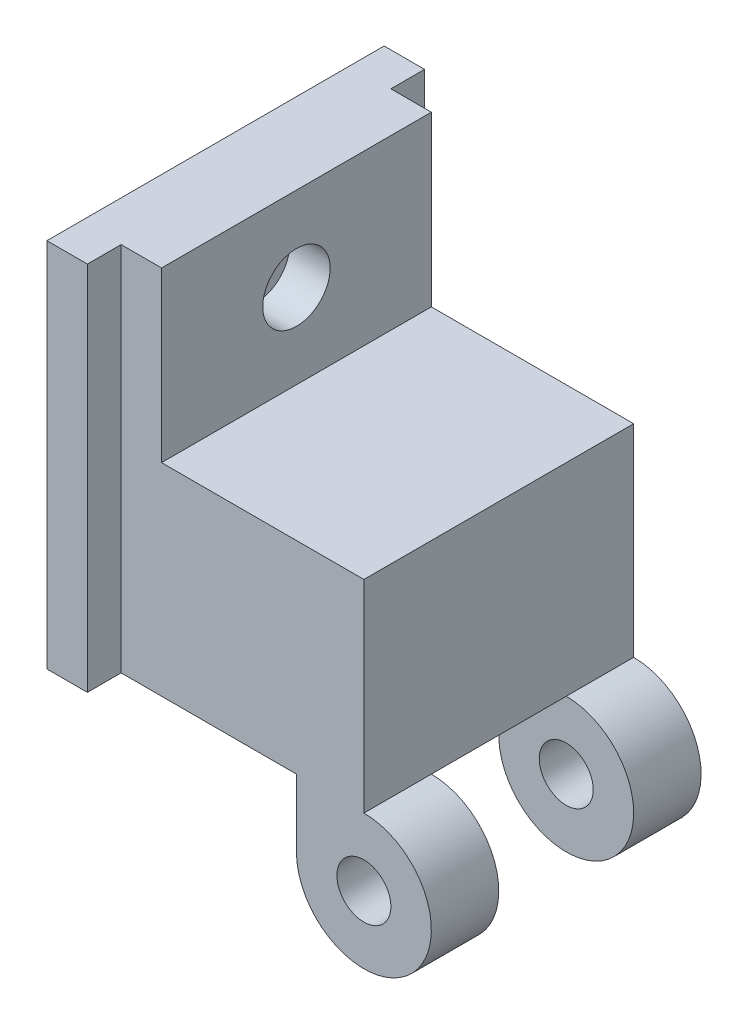
ISO-10303-21;
HEADER;
FILE_DESCRIPTION(('STEP AP214'),'2;1');
FILE_NAME('part.step','',(''),(''),'','','');
FILE_SCHEMA(('AUTOMOTIVE_DESIGN { 1 0 10303 214 1 1 1 1 }'));
ENDSEC;
DATA;
#1=APPLICATION_CONTEXT('core data for automotive mechanical design processes');
#2=APPLICATION_PROTOCOL_DEFINITION('international standard','automotive_design',2000,#1);
#3=PRODUCT_CONTEXT('',#1,'mechanical');
#4=PRODUCT('Part','Part','',(#3));
#5=PRODUCT_RELATED_PRODUCT_CATEGORY('part','',(#4));
#6=PRODUCT_DEFINITION_FORMATION('','',#4);
#7=PRODUCT_DEFINITION_CONTEXT('part definition',#1,'design');
#8=PRODUCT_DEFINITION('design','',#6,#7);
#9=PRODUCT_DEFINITION_SHAPE('','',#8);
#10=(LENGTH_UNIT() NAMED_UNIT(*) SI_UNIT(.MILLI.,.METRE.));
#11=(NAMED_UNIT(*) PLANE_ANGLE_UNIT() SI_UNIT($,.RADIAN.));
#12=(NAMED_UNIT(*) SI_UNIT($,.STERADIAN.) SOLID_ANGLE_UNIT());
#13=UNCERTAINTY_MEASURE_WITH_UNIT(LENGTH_MEASURE(1.E-05),#10,'distance_accuracy_value','');
#14=(GEOMETRIC_REPRESENTATION_CONTEXT(3) GLOBAL_UNCERTAINTY_ASSIGNED_CONTEXT((#13)) GLOBAL_UNIT_ASSIGNED_CONTEXT((#10,
#11,#12)) REPRESENTATION_CONTEXT('',''));
#15=CARTESIAN_POINT('',(0.,0.,0.));
#16=DIRECTION('',(0.,0.,1.));
#17=DIRECTION('',(1.,0.,0.));
#18=AXIS2_PLACEMENT_3D('',#15,#16,#17);
#19=CARTESIAN_POINT('',(-10.2426406871193,13.75,0.));
#20=DIRECTION('',(1.,0.,0.));
#21=DIRECTION('',(0.,0.,-1.));
#22=AXIS2_PLACEMENT_3D('',#19,#20,#21);
#23=CYLINDRICAL_SURFACE('',#22,1.5);
#24=CARTESIAN_POINT('',(-6.,13.75,0.));
#25=DIRECTION('',(-1.,0.,0.));
#26=DIRECTION('',(0.,0.,1.));
#27=AXIS2_PLACEMENT_3D('',#24,#25,#26);
#28=CIRCLE('',#27,1.5);
#29=CARTESIAN_POINT('',(-6.,13.75,1.5));
#30=VERTEX_POINT('',#29);
#31=EDGE_CURVE('E385',#30,#30,#28,.F.);
#32=ORIENTED_EDGE('',*,*,#31,.F.);
#33=EDGE_LOOP('',(#32));
#34=FACE_BOUND('',#33,.T.);
#35=CARTESIAN_POINT('',(-3.,13.75,0.));
#36=DIRECTION('',(1.,0.,0.));
#37=DIRECTION('',(0.,0.,-1.));
#38=AXIS2_PLACEMENT_3D('',#35,#36,#37);
#39=CIRCLE('',#38,1.5);
#40=CARTESIAN_POINT('',(-3.,13.75,-1.5));
#41=VERTEX_POINT('',#40);
#42=EDGE_CURVE('E381',#41,#41,#39,.T.);
#43=ORIENTED_EDGE('',*,*,#42,.T.);
#44=EDGE_LOOP('',(#43));
#45=FACE_BOUND('',#44,.T.);
#46=ADVANCED_FACE('F39',(#34,#45),#23,.F.);
#47=CARTESIAN_POINT('',(15.,-7.50000000000001,10.0000000000001));
#48=DIRECTION('',(0.,1.,0.));
#49=DIRECTION('',(0.,0.,1.));
#50=AXIS2_PLACEMENT_3D('',#47,#48,#49);
#51=PLANE('',#50);
#52=DIRECTION('',(-1.,0.,0.));
#53=VECTOR('',#52,1.);
#54=CARTESIAN_POINT('',(15.,-7.50000000000001,-5.00000000000007));
#55=LINE('',#54,#53);
#56=CARTESIAN_POINT('',(15.,-7.50000000000001,-5.00000000000007));
#57=VERTEX_POINT('',#56);
#58=CARTESIAN_POINT('',(10.0155671222792,-7.50000000000001,-5.00000000000007));
#59=VERTEX_POINT('',#58);
#60=EDGE_CURVE('E189',#57,#59,#55,.T.);
#61=ORIENTED_EDGE('',*,*,#60,.F.);
#62=DIRECTION('',(0.,0.,-1.));
#63=VECTOR('',#62,1.);
#64=CARTESIAN_POINT('',(15.,-7.50000000000001,10.0000000000001));
#65=LINE('',#64,#63);
#66=CARTESIAN_POINT('',(15.,-7.50000000000001,5.00000000000007));
#67=VERTEX_POINT('',#66);
#68=EDGE_CURVE('E136',#67,#57,#65,.T.);
#69=ORIENTED_EDGE('',*,*,#68,.F.);
#70=DIRECTION('',(-1.,0.,0.));
#71=VECTOR('',#70,1.);
#72=CARTESIAN_POINT('',(15.,-7.50000000000001,5.00000000000007));
#73=LINE('',#72,#71);
#74=CARTESIAN_POINT('',(10.0155671222792,-7.50000000000001,5.00000000000007));
#75=VERTEX_POINT('',#74);
#76=EDGE_CURVE('E124',#67,#75,#73,.T.);
#77=ORIENTED_EDGE('',*,*,#76,.T.);
#78=DIRECTION('',(0.,0.,1.));
#79=VECTOR('',#78,1.);
#80=CARTESIAN_POINT('',(10.0155671222792,-7.50000000000001,5.00000000000007));
#81=LINE('',#80,#79);
#82=CARTESIAN_POINT('',(10.0155671222792,-7.50000000000001,10.0000000000001));
#83=VERTEX_POINT('',#82);
#84=EDGE_CURVE('E104',#75,#83,#81,.T.);
#85=ORIENTED_EDGE('',*,*,#84,.T.);
#86=DIRECTION('',(-1.,0.,0.));
#87=VECTOR('',#86,1.);
#88=CARTESIAN_POINT('',(15.,-7.50000000000001,10.0000000000001));
#89=LINE('',#88,#87);
#90=CARTESIAN_POINT('',(-3.,-7.50000000000001,10.0000000000001));
#91=VERTEX_POINT('',#90);
#92=EDGE_CURVE('E122',#83,#91,#89,.T.);
#93=ORIENTED_EDGE('',*,*,#92,.T.);
#94=DIRECTION('',(0.,0.,-1.));
#95=VECTOR('',#94,1.);
#96=CARTESIAN_POINT('',(-3.,-7.50000000000001,10.0000000000001));
#97=LINE('',#96,#95);
#98=CARTESIAN_POINT('',(-3.,-7.50000000000001,12.5));
#99=VERTEX_POINT('',#98);
#100=EDGE_CURVE('E404',#99,#91,#97,.T.);
#101=ORIENTED_EDGE('',*,*,#100,.F.);
#102=DIRECTION('',(1.,0.,0.));
#103=VECTOR('',#102,1.);
#104=CARTESIAN_POINT('',(-3.,-7.50000000000001,12.5));
#105=LINE('',#104,#103);
#106=CARTESIAN_POINT('',(-6.,-7.50000000000001,12.5));
#107=VERTEX_POINT('',#106);
#108=EDGE_CURVE('E401',#107,#99,#105,.T.);
#109=ORIENTED_EDGE('',*,*,#108,.F.);
#110=DIRECTION('',(0.,0.,1.));
#111=VECTOR('',#110,1.);
#112=CARTESIAN_POINT('',(-6.,-7.50000000000001,12.5));
#113=LINE('',#112,#111);
#114=CARTESIAN_POINT('',(-6.,-7.50000000000001,-12.5));
#115=VERTEX_POINT('',#114);
#116=EDGE_CURVE('E398',#115,#107,#113,.T.);
#117=ORIENTED_EDGE('',*,*,#116,.F.);
#118=DIRECTION('',(-1.,0.,0.));
#119=VECTOR('',#118,1.);
#120=CARTESIAN_POINT('',(-6.,-7.50000000000001,-12.5));
#121=LINE('',#120,#119);
#122=CARTESIAN_POINT('',(-3.,-7.50000000000001,-12.5));
#123=VERTEX_POINT('',#122);
#124=EDGE_CURVE('E395',#123,#115,#121,.T.);
#125=ORIENTED_EDGE('',*,*,#124,.F.);
#126=DIRECTION('',(0.,0.,-1.));
#127=VECTOR('',#126,1.);
#128=CARTESIAN_POINT('',(-3.,-7.50000000000001,-12.5));
#129=LINE('',#128,#127);
#130=CARTESIAN_POINT('',(-3.,-7.50000000000001,-9.99999999999993));
#131=VERTEX_POINT('',#130);
#132=EDGE_CURVE('E389',#131,#123,#129,.T.);
#133=ORIENTED_EDGE('',*,*,#132,.F.);
#134=DIRECTION('',(-1.,0.,0.));
#135=VECTOR('',#134,1.);
#136=CARTESIAN_POINT('',(15.,-7.50000000000001,-9.99999999999993));
#137=LINE('',#136,#135);
#138=CARTESIAN_POINT('',(10.0155671222792,-7.50000000000001,-10.0000000000001));
#139=VERTEX_POINT('',#138);
#140=EDGE_CURVE('E138',#139,#131,#137,.T.);
#141=ORIENTED_EDGE('',*,*,#140,.F.);
#142=DIRECTION('',(0.,0.,-1.));
#143=VECTOR('',#142,1.);
#144=CARTESIAN_POINT('',(10.0155671222792,-7.50000000000001,-5.00000000000007));
#145=LINE('',#144,#143);
#146=EDGE_CURVE('E199',#59,#139,#145,.T.);
#147=ORIENTED_EDGE('',*,*,#146,.F.);
#148=EDGE_LOOP('',(#61,#69,#77,#85,#93,#101,#109,#117,#125,#133,#141,#147));
#149=FACE_BOUND('',#148,.T.);
#150=ADVANCED_FACE('F211',(#149),#51,.F.);
#151=CARTESIAN_POINT('',(15.,-7.50000000000001,-9.99999999999993));
#152=DIRECTION('',(0.,0.,1.));
#153=DIRECTION('',(1.,0.,0.));
#154=AXIS2_PLACEMENT_3D('',#151,#152,#153);
#155=PLANE('',#154);
#156=ORIENTED_EDGE('',*,*,#140,.T.);
#157=DIRECTION('',(0.,-1.,0.));
#158=VECTOR('',#157,1.);
#159=CARTESIAN_POINT('',(-3.,20.,-9.99999999999993));
#160=LINE('',#159,#158);
#161=CARTESIAN_POINT('',(-3.,20.,-9.99999999999993));
#162=VERTEX_POINT('',#161);
#163=EDGE_CURVE('E181',#162,#131,#160,.T.);
#164=ORIENTED_EDGE('',*,*,#163,.F.);
#165=DIRECTION('',(1.,0.,0.));
#166=VECTOR('',#165,1.);
#167=CARTESIAN_POINT('',(0.,20.,-9.99999999999993));
#168=LINE('',#167,#166);
#169=CARTESIAN_POINT('',(0.,20.,-9.99999999999993));
#170=VERTEX_POINT('',#169);
#171=EDGE_CURVE('E165',#162,#170,#168,.T.);
#172=ORIENTED_EDGE('',*,*,#171,.T.);
#173=DIRECTION('',(0.,-1.,0.));
#174=VECTOR('',#173,1.);
#175=CARTESIAN_POINT('',(0.,20.,-9.99999999999993));
#176=LINE('',#175,#174);
#177=CARTESIAN_POINT('',(0.,7.50000000000001,-9.99999999999993));
#178=VERTEX_POINT('',#177);
#179=EDGE_CURVE('E154',#170,#178,#176,.T.);
#180=ORIENTED_EDGE('',*,*,#179,.T.);
#181=DIRECTION('',(-1.,0.,0.));
#182=VECTOR('',#181,1.);
#183=CARTESIAN_POINT('',(15.,7.50000000000001,-9.99999999999993));
#184=LINE('',#183,#182);
#185=CARTESIAN_POINT('',(15.,7.50000000000001,-9.99999999999993));
#186=VERTEX_POINT('',#185);
#187=EDGE_CURVE('E11',#186,#178,#184,.T.);
#188=ORIENTED_EDGE('',*,*,#187,.F.);
#189=DIRECTION('',(0.,1.,0.));
#190=VECTOR('',#189,1.);
#191=CARTESIAN_POINT('',(15.,-7.50000000000001,-9.99999999999993));
#192=LINE('',#191,#190);
#193=CARTESIAN_POINT('',(15.,-7.50000000000001,-9.99999999999993));
#194=VERTEX_POINT('',#193);
#195=EDGE_CURVE('E129',#194,#186,#192,.T.);
#196=ORIENTED_EDGE('',*,*,#195,.F.);
#197=CARTESIAN_POINT('',(15.,-12.5,-10.0000000000001));
#198=DIRECTION('',(0.,0.,1.));
#199=DIRECTION('',(1.,0.,0.));
#200=AXIS2_PLACEMENT_3D('',#197,#198,#199);
#201=CIRCLE('',#200,5.);
#202=CARTESIAN_POINT('',(10.0155671222792,-12.1057552949038,-10.0000000000001));
#203=VERTEX_POINT('',#202);
#204=EDGE_CURVE('E63',#203,#194,#201,.T.);
#205=ORIENTED_EDGE('',*,*,#204,.F.);
#206=DIRECTION('',(0.,-1.,0.));
#207=VECTOR('',#206,1.);
#208=CARTESIAN_POINT('',(10.0155671222792,-12.1057552949038,-10.0000000000001));
#209=LINE('',#208,#207);
#210=EDGE_CURVE('E186',#139,#203,#209,.T.);
#211=ORIENTED_EDGE('',*,*,#210,.F.);
#212=EDGE_LOOP('',(#156,#164,#172,#180,#188,#196,#205,#211));
#213=FACE_BOUND('',#212,.T.);
#214=CARTESIAN_POINT('',(15.,-12.5,-10.0000000000001));
#215=DIRECTION('',(0.,0.,1.));
#216=DIRECTION('',(1.,0.,0.));
#217=AXIS2_PLACEMENT_3D('',#214,#215,#216);
#218=CIRCLE('',#217,2.00000000000001);
#219=CARTESIAN_POINT('',(17.,-12.5,-10.0000000000001));
#220=VERTEX_POINT('',#219);
#221=EDGE_CURVE('E178',#220,#220,#218,.T.);
#222=ORIENTED_EDGE('',*,*,#221,.T.);
#223=EDGE_LOOP('',(#222));
#224=FACE_BOUND('',#223,.T.);
#225=ADVANCED_FACE('F41',(#213,#224),#155,.F.);
#226=CARTESIAN_POINT('',(15.,7.50000000000001,10.0000000000001));
#227=DIRECTION('',(0.,-1.,0.));
#228=DIRECTION('',(0.,0.,-1.));
#229=AXIS2_PLACEMENT_3D('',#226,#227,#228);
#230=PLANE('',#229);
#231=DIRECTION('',(0.,0.,1.));
#232=VECTOR('',#231,1.);
#233=CARTESIAN_POINT('',(0.,7.50000000000001,10.0000000000001));
#234=LINE('',#233,#232);
#235=CARTESIAN_POINT('',(0.,7.50000000000001,10.0000000000001));
#236=VERTEX_POINT('',#235);
#237=EDGE_CURVE('E103',#178,#236,#234,.T.);
#238=ORIENTED_EDGE('',*,*,#237,.T.);
#239=DIRECTION('',(-1.,0.,0.));
#240=VECTOR('',#239,1.);
#241=CARTESIAN_POINT('',(15.,7.50000000000001,10.0000000000001));
#242=LINE('',#241,#240);
#243=CARTESIAN_POINT('',(15.,7.50000000000001,10.0000000000001));
#244=VERTEX_POINT('',#243);
#245=EDGE_CURVE('E47',#244,#236,#242,.T.);
#246=ORIENTED_EDGE('',*,*,#245,.F.);
#247=DIRECTION('',(0.,0.,1.));
#248=VECTOR('',#247,1.);
#249=CARTESIAN_POINT('',(15.,7.50000000000001,10.0000000000001));
#250=LINE('',#249,#248);
#251=EDGE_CURVE('E132',#186,#244,#250,.T.);
#252=ORIENTED_EDGE('',*,*,#251,.F.);
#253=ORIENTED_EDGE('',*,*,#187,.T.);
#254=EDGE_LOOP('',(#238,#246,#252,#253));
#255=FACE_BOUND('',#254,.T.);
#256=ADVANCED_FACE('F147',(#255),#230,.F.);
#257=CARTESIAN_POINT('',(15.,-7.50000000000001,10.0000000000001));
#258=DIRECTION('',(0.,0.,-1.));
#259=DIRECTION('',(-1.,0.,0.));
#260=AXIS2_PLACEMENT_3D('',#257,#258,#259);
#261=PLANE('',#260);
#262=ORIENTED_EDGE('',*,*,#245,.T.);
#263=DIRECTION('',(0.,-1.,0.));
#264=VECTOR('',#263,1.);
#265=CARTESIAN_POINT('',(0.,20.,10.0000000000001));
#266=LINE('',#265,#264);
#267=CARTESIAN_POINT('',(0.,20.,10.0000000000001));
#268=VERTEX_POINT('',#267);
#269=EDGE_CURVE('E76',#268,#236,#266,.T.);
#270=ORIENTED_EDGE('',*,*,#269,.F.);
#271=DIRECTION('',(-1.,0.,0.));
#272=VECTOR('',#271,1.);
#273=CARTESIAN_POINT('',(-3.,20.,10.0000000000001));
#274=LINE('',#273,#272);
#275=CARTESIAN_POINT('',(-3.,20.,10.0000000000001));
#276=VERTEX_POINT('',#275);
#277=EDGE_CURVE('E412',#268,#276,#274,.T.);
#278=ORIENTED_EDGE('',*,*,#277,.T.);
#279=DIRECTION('',(0.,-1.,0.));
#280=VECTOR('',#279,1.);
#281=CARTESIAN_POINT('',(-3.,20.,10.0000000000001));
#282=LINE('',#281,#280);
#283=EDGE_CURVE('E168',#276,#91,#282,.T.);
#284=ORIENTED_EDGE('',*,*,#283,.T.);
#285=ORIENTED_EDGE('',*,*,#92,.F.);
#286=DIRECTION('',(0.,-1.,0.));
#287=VECTOR('',#286,1.);
#288=CARTESIAN_POINT('',(10.0155671222792,-12.1057552949038,10.0000000000001));
#289=LINE('',#288,#287);
#290=CARTESIAN_POINT('',(10.0155671222792,-12.1057552949038,10.0000000000001));
#291=VERTEX_POINT('',#290);
#292=EDGE_CURVE('E99',#83,#291,#289,.T.);
#293=ORIENTED_EDGE('',*,*,#292,.T.);
#294=CARTESIAN_POINT('',(15.,-12.5,10.0000000000001));
#295=DIRECTION('',(0.,0.,1.));
#296=DIRECTION('',(1.,0.,0.));
#297=AXIS2_PLACEMENT_3D('',#294,#295,#296);
#298=CIRCLE('',#297,5.);
#299=CARTESIAN_POINT('',(15.,-7.50000000000001,10.0000000000001));
#300=VERTEX_POINT('',#299);
#301=EDGE_CURVE('E107',#291,#300,#298,.T.);
#302=ORIENTED_EDGE('',*,*,#301,.T.);
#303=DIRECTION('',(0.,-1.,0.));
#304=VECTOR('',#303,1.);
#305=CARTESIAN_POINT('',(15.,-7.50000000000001,10.0000000000001));
#306=LINE('',#305,#304);
#307=EDGE_CURVE('E134',#244,#300,#306,.T.);
#308=ORIENTED_EDGE('',*,*,#307,.F.);
#309=EDGE_LOOP('',(#262,#270,#278,#284,#285,#293,#302,#308));
#310=FACE_BOUND('',#309,.T.);
#311=CARTESIAN_POINT('',(15.,-12.5,10.0000000000001));
#312=DIRECTION('',(0.,0.,1.));
#313=DIRECTION('',(1.,0.,0.));
#314=AXIS2_PLACEMENT_3D('',#311,#312,#313);
#315=CIRCLE('',#314,2.00000000000001);
#316=CARTESIAN_POINT('',(17.,-12.5,10.0000000000001));
#317=VERTEX_POINT('',#316);
#318=EDGE_CURVE('E198',#317,#317,#315,.T.);
#319=ORIENTED_EDGE('',*,*,#318,.F.);
#320=EDGE_LOOP('',(#319));
#321=FACE_BOUND('',#320,.T.);
#322=ADVANCED_FACE('F118',(#310,#321),#261,.F.);
#323=CARTESIAN_POINT('',(15.,0.,0.));
#324=DIRECTION('',(-1.,0.,0.));
#325=DIRECTION('',(0.,0.,1.));
#326=AXIS2_PLACEMENT_3D('',#323,#324,#325);
#327=PLANE('',#326);
#328=ORIENTED_EDGE('',*,*,#195,.T.);
#329=ORIENTED_EDGE('',*,*,#251,.T.);
#330=ORIENTED_EDGE('',*,*,#307,.T.);
#331=EDGE_CURVE('E110',#300,#67,#65,.T.);
#332=ORIENTED_EDGE('',*,*,#331,.T.);
#333=ORIENTED_EDGE('',*,*,#68,.T.);
#334=DIRECTION('',(0.,0.,-1.));
#335=VECTOR('',#334,1.);
#336=CARTESIAN_POINT('',(15.,-7.50000000000001,-5.00000000000007));
#337=LINE('',#336,#335);
#338=EDGE_CURVE('E196',#57,#194,#337,.T.);
#339=ORIENTED_EDGE('',*,*,#338,.T.);
#340=EDGE_LOOP('',(#328,#329,#330,#332,#333,#339));
#341=FACE_BOUND('',#340,.T.);
#342=ADVANCED_FACE('F309',(#341),#327,.F.);
#343=CARTESIAN_POINT('',(15.,-12.5,5.00000000000007));
#344=DIRECTION('',(0.,0.,1.));
#345=DIRECTION('',(1.,0.,0.));
#346=AXIS2_PLACEMENT_3D('',#343,#344,#345);
#347=CYLINDRICAL_SURFACE('',#346,5.);
#348=ORIENTED_EDGE('',*,*,#301,.F.);
#349=DIRECTION('',(0.,0.,1.));
#350=VECTOR('',#349,1.);
#351=CARTESIAN_POINT('',(10.0155671222792,-12.1057552949038,5.00000000000007));
#352=LINE('',#351,#350);
#353=CARTESIAN_POINT('',(10.0155671222792,-12.1057552949038,5.00000000000007));
#354=VERTEX_POINT('',#353);
#355=EDGE_CURVE('E83',#354,#291,#352,.T.);
#356=ORIENTED_EDGE('',*,*,#355,.F.);
#357=CARTESIAN_POINT('',(15.,-12.5,5.00000000000007));
#358=DIRECTION('',(0.,0.,1.));
#359=DIRECTION('',(1.,0.,0.));
#360=AXIS2_PLACEMENT_3D('',#357,#358,#359);
#361=CIRCLE('',#360,5.);
#362=EDGE_CURVE('E54',#354,#67,#361,.T.);
#363=ORIENTED_EDGE('',*,*,#362,.T.);
#364=ORIENTED_EDGE('',*,*,#331,.F.);
#365=EDGE_LOOP('',(#348,#356,#363,#364));
#366=FACE_BOUND('',#365,.T.);
#367=ADVANCED_FACE('F108',(#366),#347,.T.);
#368=CARTESIAN_POINT('',(10.0155671222792,-12.1057552949038,5.00000000000007));
#369=DIRECTION('',(-1.,0.,0.));
#370=DIRECTION('',(0.,0.,1.));
#371=AXIS2_PLACEMENT_3D('',#368,#369,#370);
#372=PLANE('',#371);
#373=ORIENTED_EDGE('',*,*,#292,.F.);
#374=ORIENTED_EDGE('',*,*,#84,.F.);
#375=DIRECTION('',(0.,-1.,0.));
#376=VECTOR('',#375,1.);
#377=CARTESIAN_POINT('',(10.0155671222792,-12.1057552949038,5.00000000000007));
#378=LINE('',#377,#376);
#379=EDGE_CURVE('E102',#75,#354,#378,.T.);
#380=ORIENTED_EDGE('',*,*,#379,.T.);
#381=ORIENTED_EDGE('',*,*,#355,.T.);
#382=EDGE_LOOP('',(#373,#374,#380,#381));
#383=FACE_BOUND('',#382,.T.);
#384=ADVANCED_FACE('F97',(#383),#372,.T.);
#385=CARTESIAN_POINT('',(15.,-12.5,5.00000000000007));
#386=DIRECTION('',(0.,0.,1.));
#387=DIRECTION('',(1.,0.,0.));
#388=AXIS2_PLACEMENT_3D('',#385,#386,#387);
#389=PLANE('',#388);
#390=CARTESIAN_POINT('',(15.,-12.5,5.00000000000007));
#391=DIRECTION('',(0.,0.,1.));
#392=DIRECTION('',(1.,0.,0.));
#393=AXIS2_PLACEMENT_3D('',#390,#391,#392);
#394=CIRCLE('',#393,2.00000000000001);
#395=CARTESIAN_POINT('',(17.,-12.5,5.00000000000007));
#396=VERTEX_POINT('',#395);
#397=EDGE_CURVE('E114',#396,#396,#394,.T.);
#398=ORIENTED_EDGE('',*,*,#397,.T.);
#399=EDGE_LOOP('',(#398));
#400=FACE_BOUND('',#399,.T.);
#401=ORIENTED_EDGE('',*,*,#362,.F.);
#402=ORIENTED_EDGE('',*,*,#379,.F.);
#403=ORIENTED_EDGE('',*,*,#76,.F.);
#404=EDGE_LOOP('',(#401,#402,#403));
#405=FACE_BOUND('',#404,.T.);
#406=ADVANCED_FACE('F214',(#400,#405),#389,.F.);
#407=CARTESIAN_POINT('',(15.,-12.5,5.00000000000007));
#408=DIRECTION('',(0.,0.,1.));
#409=DIRECTION('',(1.,0.,0.));
#410=AXIS2_PLACEMENT_3D('',#407,#408,#409);
#411=CYLINDRICAL_SURFACE('',#410,2.00000000000001);
#412=ORIENTED_EDGE('',*,*,#397,.F.);
#413=EDGE_LOOP('',(#412));
#414=FACE_BOUND('',#413,.T.);
#415=ORIENTED_EDGE('',*,*,#318,.T.);
#416=EDGE_LOOP('',(#415));
#417=FACE_BOUND('',#416,.T.);
#418=ADVANCED_FACE('F216',(#414,#417),#411,.F.);
#419=CARTESIAN_POINT('',(15.,-12.5,-5.00000000000007));
#420=DIRECTION('',(0.,0.,-1.));
#421=DIRECTION('',(1.,0.,0.));
#422=AXIS2_PLACEMENT_3D('',#419,#420,#421);
#423=PLANE('',#422);
#424=CARTESIAN_POINT('',(15.,-12.5,-5.00000000000007));
#425=DIRECTION('',(0.,0.,1.));
#426=DIRECTION('',(1.,0.,0.));
#427=AXIS2_PLACEMENT_3D('',#424,#425,#426);
#428=CIRCLE('',#427,5.);
#429=CARTESIAN_POINT('',(10.0155671222792,-12.1057552949038,-5.00000000000007));
#430=VERTEX_POINT('',#429);
#431=EDGE_CURVE('E182',#430,#57,#428,.T.);
#432=ORIENTED_EDGE('',*,*,#431,.T.);
#433=ORIENTED_EDGE('',*,*,#60,.T.);
#434=DIRECTION('',(0.,-1.,0.));
#435=VECTOR('',#434,1.);
#436=CARTESIAN_POINT('',(10.0155671222792,-12.1057552949038,-5.00000000000007));
#437=LINE('',#436,#435);
#438=EDGE_CURVE('E185',#59,#430,#437,.T.);
#439=ORIENTED_EDGE('',*,*,#438,.T.);
#440=EDGE_LOOP('',(#432,#433,#439));
#441=FACE_BOUND('',#440,.T.);
#442=CARTESIAN_POINT('',(15.,-12.5,-5.00000000000007));
#443=DIRECTION('',(0.,0.,1.));
#444=DIRECTION('',(1.,0.,0.));
#445=AXIS2_PLACEMENT_3D('',#442,#443,#444);
#446=CIRCLE('',#445,2.00000000000001);
#447=CARTESIAN_POINT('',(17.,-12.5,-5.00000000000007));
#448=VERTEX_POINT('',#447);
#449=EDGE_CURVE('E175',#448,#448,#446,.T.);
#450=ORIENTED_EDGE('',*,*,#449,.F.);
#451=EDGE_LOOP('',(#450));
#452=FACE_BOUND('',#451,.T.);
#453=ADVANCED_FACE('F223',(#441,#452),#423,.F.);
#454=CARTESIAN_POINT('',(15.,-12.5,-5.00000000000007));
#455=DIRECTION('',(0.,0.,-1.));
#456=DIRECTION('',(-1.,0.,0.));
#457=AXIS2_PLACEMENT_3D('',#454,#455,#456);
#458=CYLINDRICAL_SURFACE('',#457,5.);
#459=ORIENTED_EDGE('',*,*,#204,.T.);
#460=ORIENTED_EDGE('',*,*,#338,.F.);
#461=ORIENTED_EDGE('',*,*,#431,.F.);
#462=DIRECTION('',(0.,0.,-1.));
#463=VECTOR('',#462,1.);
#464=CARTESIAN_POINT('',(10.0155671222792,-12.1057552949038,-5.00000000000007));
#465=LINE('',#464,#463);
#466=EDGE_CURVE('E192',#430,#203,#465,.T.);
#467=ORIENTED_EDGE('',*,*,#466,.T.);
#468=EDGE_LOOP('',(#459,#460,#461,#467));
#469=FACE_BOUND('',#468,.T.);
#470=ADVANCED_FACE('F275',(#469),#458,.T.);
#471=CARTESIAN_POINT('',(10.0155671222792,-12.1057552949038,-5.00000000000007));
#472=DIRECTION('',(1.,0.,0.));
#473=DIRECTION('',(0.,0.,-1.));
#474=AXIS2_PLACEMENT_3D('',#471,#472,#473);
#475=PLANE('',#474);
#476=ORIENTED_EDGE('',*,*,#210,.T.);
#477=ORIENTED_EDGE('',*,*,#466,.F.);
#478=ORIENTED_EDGE('',*,*,#438,.F.);
#479=ORIENTED_EDGE('',*,*,#146,.T.);
#480=EDGE_LOOP('',(#476,#477,#478,#479));
#481=FACE_BOUND('',#480,.T.);
#482=ADVANCED_FACE('F271',(#481),#475,.F.);
#483=CARTESIAN_POINT('',(15.,-12.5,-5.00000000000007));
#484=DIRECTION('',(0.,0.,-1.));
#485=DIRECTION('',(-1.,0.,0.));
#486=AXIS2_PLACEMENT_3D('',#483,#484,#485);
#487=CYLINDRICAL_SURFACE('',#486,2.00000000000001);
#488=ORIENTED_EDGE('',*,*,#449,.T.);
#489=EDGE_LOOP('',(#488));
#490=FACE_BOUND('',#489,.T.);
#491=ORIENTED_EDGE('',*,*,#221,.F.);
#492=EDGE_LOOP('',(#491));
#493=FACE_BOUND('',#492,.T.);
#494=ADVANCED_FACE('F267',(#490,#493),#487,.F.);
#495=CARTESIAN_POINT('',(0.,20.,10.0000000000001));
#496=DIRECTION('',(1.,0.,0.));
#497=DIRECTION('',(0.,0.,-1.));
#498=AXIS2_PLACEMENT_3D('',#495,#496,#497);
#499=PLANE('',#498);
#500=CARTESIAN_POINT('',(0.,13.75,0.));
#501=DIRECTION('',(1.,0.,0.));
#502=DIRECTION('',(0.,0.,-1.));
#503=AXIS2_PLACEMENT_3D('',#500,#501,#502);
#504=CIRCLE('',#503,2.5);
#505=CARTESIAN_POINT('',(0.,13.75,-2.5));
#506=VERTEX_POINT('',#505);
#507=EDGE_CURVE('E386',#506,#506,#504,.T.);
#508=ORIENTED_EDGE('',*,*,#507,.F.);
#509=EDGE_LOOP('',(#508));
#510=FACE_BOUND('',#509,.T.);
#511=ORIENTED_EDGE('',*,*,#237,.F.);
#512=ORIENTED_EDGE('',*,*,#179,.F.);
#513=DIRECTION('',(0.,0.,1.));
#514=VECTOR('',#513,1.);
#515=CARTESIAN_POINT('',(0.,20.,10.0000000000001));
#516=LINE('',#515,#514);
#517=EDGE_CURVE('E410',#170,#268,#516,.T.);
#518=ORIENTED_EDGE('',*,*,#517,.T.);
#519=ORIENTED_EDGE('',*,*,#269,.T.);
#520=EDGE_LOOP('',(#511,#512,#518,#519));
#521=FACE_BOUND('',#520,.T.);
#522=ADVANCED_FACE('F152',(#510,#521),#499,.T.);
#523=CARTESIAN_POINT('',(-3.,20.,-12.5));
#524=DIRECTION('',(1.,0.,0.));
#525=DIRECTION('',(0.,0.,-1.));
#526=AXIS2_PLACEMENT_3D('',#523,#524,#525);
#527=PLANE('',#526);
#528=ORIENTED_EDGE('',*,*,#163,.T.);
#529=ORIENTED_EDGE('',*,*,#132,.T.);
#530=DIRECTION('',(0.,-1.,0.));
#531=VECTOR('',#530,1.);
#532=CARTESIAN_POINT('',(-3.,20.,-12.5));
#533=LINE('',#532,#531);
#534=CARTESIAN_POINT('',(-3.,20.,-12.5));
#535=VERTEX_POINT('',#534);
#536=EDGE_CURVE('E427',#535,#123,#533,.T.);
#537=ORIENTED_EDGE('',*,*,#536,.F.);
#538=DIRECTION('',(0.,0.,1.));
#539=VECTOR('',#538,1.);
#540=CARTESIAN_POINT('',(-3.,20.,-12.5));
#541=LINE('',#540,#539);
#542=EDGE_CURVE('E166',#535,#162,#541,.T.);
#543=ORIENTED_EDGE('',*,*,#542,.T.);
#544=EDGE_LOOP('',(#528,#529,#537,#543));
#545=FACE_BOUND('',#544,.T.);
#546=ADVANCED_FACE('F246',(#545),#527,.T.);
#547=CARTESIAN_POINT('',(-6.,20.,-12.5));
#548=DIRECTION('',(0.,0.,-1.));
#549=DIRECTION('',(-1.,0.,0.));
#550=AXIS2_PLACEMENT_3D('',#547,#548,#549);
#551=PLANE('',#550);
#552=ORIENTED_EDGE('',*,*,#536,.T.);
#553=ORIENTED_EDGE('',*,*,#124,.T.);
#554=DIRECTION('',(0.,-1.,0.));
#555=VECTOR('',#554,1.);
#556=CARTESIAN_POINT('',(-6.,20.,-12.5));
#557=LINE('',#556,#555);
#558=CARTESIAN_POINT('',(-6.,20.,-12.5));
#559=VERTEX_POINT('',#558);
#560=EDGE_CURVE('E430',#559,#115,#557,.T.);
#561=ORIENTED_EDGE('',*,*,#560,.F.);
#562=DIRECTION('',(1.,0.,0.));
#563=VECTOR('',#562,1.);
#564=CARTESIAN_POINT('',(-6.,20.,-12.5));
#565=LINE('',#564,#563);
#566=EDGE_CURVE('E171',#559,#535,#565,.T.);
#567=ORIENTED_EDGE('',*,*,#566,.T.);
#568=EDGE_LOOP('',(#552,#553,#561,#567));
#569=FACE_BOUND('',#568,.T.);
#570=ADVANCED_FACE('F249',(#569),#551,.T.);
#571=CARTESIAN_POINT('',(-6.,20.,12.5));
#572=DIRECTION('',(-1.,0.,0.));
#573=DIRECTION('',(0.,0.,1.));
#574=AXIS2_PLACEMENT_3D('',#571,#572,#573);
#575=PLANE('',#574);
#576=ORIENTED_EDGE('',*,*,#31,.T.);
#577=EDGE_LOOP('',(#576));
#578=FACE_BOUND('',#577,.T.);
#579=ORIENTED_EDGE('',*,*,#560,.T.);
#580=ORIENTED_EDGE('',*,*,#116,.T.);
#581=DIRECTION('',(0.,-1.,0.));
#582=VECTOR('',#581,1.);
#583=CARTESIAN_POINT('',(-6.,20.,12.5));
#584=LINE('',#583,#582);
#585=CARTESIAN_POINT('',(-6.,20.,12.5));
#586=VERTEX_POINT('',#585);
#587=EDGE_CURVE('E433',#586,#107,#584,.T.);
#588=ORIENTED_EDGE('',*,*,#587,.F.);
#589=DIRECTION('',(0.,0.,-1.));
#590=VECTOR('',#589,1.);
#591=CARTESIAN_POINT('',(-6.,20.,12.5));
#592=LINE('',#591,#590);
#593=EDGE_CURVE('E420',#586,#559,#592,.T.);
#594=ORIENTED_EDGE('',*,*,#593,.T.);
#595=EDGE_LOOP('',(#579,#580,#588,#594));
#596=FACE_BOUND('',#595,.T.);
#597=ADVANCED_FACE('F253',(#578,#596),#575,.T.);
#598=CARTESIAN_POINT('',(-3.,20.,12.5));
#599=DIRECTION('',(0.,0.,1.));
#600=DIRECTION('',(1.,0.,0.));
#601=AXIS2_PLACEMENT_3D('',#598,#599,#600);
#602=PLANE('',#601);
#603=ORIENTED_EDGE('',*,*,#587,.T.);
#604=ORIENTED_EDGE('',*,*,#108,.T.);
#605=DIRECTION('',(0.,-1.,0.));
#606=VECTOR('',#605,1.);
#607=CARTESIAN_POINT('',(-3.,20.,12.5));
#608=LINE('',#607,#606);
#609=CARTESIAN_POINT('',(-3.,20.,12.5));
#610=VERTEX_POINT('',#609);
#611=EDGE_CURVE('E436',#610,#99,#608,.T.);
#612=ORIENTED_EDGE('',*,*,#611,.F.);
#613=DIRECTION('',(-1.,0.,0.));
#614=VECTOR('',#613,1.);
#615=CARTESIAN_POINT('',(-3.,20.,12.5));
#616=LINE('',#615,#614);
#617=EDGE_CURVE('E417',#610,#586,#616,.T.);
#618=ORIENTED_EDGE('',*,*,#617,.T.);
#619=EDGE_LOOP('',(#603,#604,#612,#618));
#620=FACE_BOUND('',#619,.T.);
#621=ADVANCED_FACE('F257',(#620),#602,.T.);
#622=CARTESIAN_POINT('',(-3.,20.,10.0000000000001));
#623=DIRECTION('',(1.,0.,0.));
#624=DIRECTION('',(0.,0.,-1.));
#625=AXIS2_PLACEMENT_3D('',#622,#623,#624);
#626=PLANE('',#625);
#627=ORIENTED_EDGE('',*,*,#611,.T.);
#628=ORIENTED_EDGE('',*,*,#100,.T.);
#629=ORIENTED_EDGE('',*,*,#283,.F.);
#630=DIRECTION('',(0.,0.,1.));
#631=VECTOR('',#630,1.);
#632=CARTESIAN_POINT('',(-3.,20.,10.0000000000001));
#633=LINE('',#632,#631);
#634=EDGE_CURVE('E414',#276,#610,#633,.T.);
#635=ORIENTED_EDGE('',*,*,#634,.T.);
#636=EDGE_LOOP('',(#627,#628,#629,#635));
#637=FACE_BOUND('',#636,.T.);
#638=ADVANCED_FACE('F244',(#637),#626,.T.);
#639=CARTESIAN_POINT('',(0.,20.,0.));
#640=DIRECTION('',(0.,1.,0.));
#641=DIRECTION('',(0.,0.,1.));
#642=AXIS2_PLACEMENT_3D('',#639,#640,#641);
#643=PLANE('',#642);
#644=ORIENTED_EDGE('',*,*,#171,.F.);
#645=ORIENTED_EDGE('',*,*,#542,.F.);
#646=ORIENTED_EDGE('',*,*,#566,.F.);
#647=ORIENTED_EDGE('',*,*,#593,.F.);
#648=ORIENTED_EDGE('',*,*,#617,.F.);
#649=ORIENTED_EDGE('',*,*,#634,.F.);
#650=ORIENTED_EDGE('',*,*,#277,.F.);
#651=ORIENTED_EDGE('',*,*,#517,.F.);
#652=EDGE_LOOP('',(#644,#645,#646,#647,#648,#649,#650,#651));
#653=FACE_BOUND('',#652,.T.);
#654=ADVANCED_FACE('F242',(#653),#643,.T.);
#655=CARTESIAN_POINT('',(-3.,13.75,0.));
#656=DIRECTION('',(1.,0.,0.));
#657=DIRECTION('',(0.,0.,-1.));
#658=AXIS2_PLACEMENT_3D('',#655,#656,#657);
#659=CYLINDRICAL_SURFACE('',#658,2.5);
#660=CARTESIAN_POINT('',(-3.,13.75,0.));
#661=DIRECTION('',(1.,0.,0.));
#662=DIRECTION('',(0.,0.,-1.));
#663=AXIS2_PLACEMENT_3D('',#660,#661,#662);
#664=CIRCLE('',#663,2.5);
#665=CARTESIAN_POINT('',(-3.,13.75,-2.5));
#666=VERTEX_POINT('',#665);
#667=EDGE_CURVE('E384',#666,#666,#664,.T.);
#668=ORIENTED_EDGE('',*,*,#667,.F.);
#669=EDGE_LOOP('',(#668));
#670=FACE_BOUND('',#669,.T.);
#671=ORIENTED_EDGE('',*,*,#507,.T.);
#672=EDGE_LOOP('',(#671));
#673=FACE_BOUND('',#672,.T.);
#674=ADVANCED_FACE('F240',(#670,#673),#659,.F.);
#675=CARTESIAN_POINT('',(-3.,13.75,0.));
#676=DIRECTION('',(1.,0.,0.));
#677=DIRECTION('',(0.,0.,-1.));
#678=AXIS2_PLACEMENT_3D('',#675,#676,#677);
#679=PLANE('',#678);
#680=ORIENTED_EDGE('',*,*,#42,.F.);
#681=EDGE_LOOP('',(#680));
#682=FACE_BOUND('',#681,.T.);
#683=ORIENTED_EDGE('',*,*,#667,.T.);
#684=EDGE_LOOP('',(#683));
#685=FACE_BOUND('',#684,.T.);
#686=ADVANCED_FACE('F364',(#682,#685),#679,.T.);
#687=CLOSED_SHELL('',(#46,#150,#225,#256,#322,#342,#367,#384,#406,#418,#453,#470,#482,#494,#522,
#546,#570,#597,#621,#638,#654,#674,#686));
#688=MANIFOLD_SOLID_BREP('B2',#687);
#689=ADVANCED_BREP_SHAPE_REPRESENTATION('',(#18,#688),#14);
#690=SHAPE_DEFINITION_REPRESENTATION(#9,#689);
ENDSEC;
END-ISO-10303-21;
